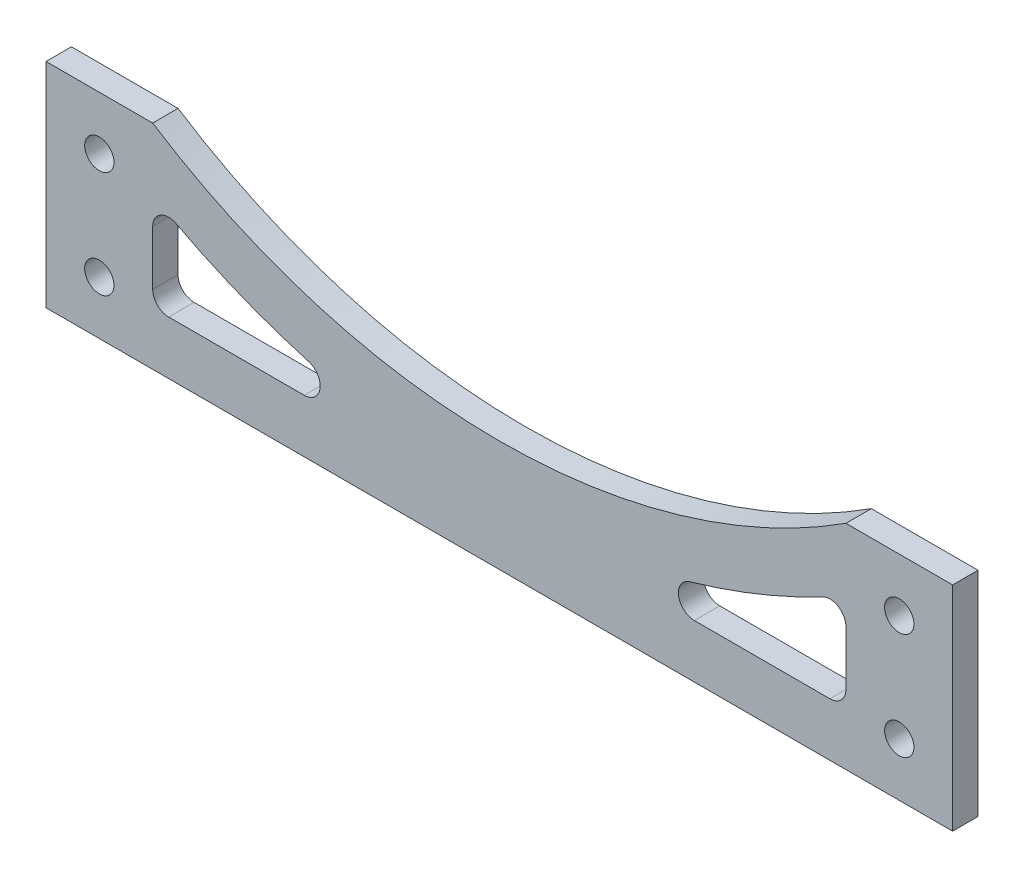
ISO-10303-21;
HEADER;
FILE_DESCRIPTION(('STEP AP214'),'2;1');
FILE_NAME('part.step','',(''),(''),'','','');
FILE_SCHEMA(('AUTOMOTIVE_DESIGN { 1 0 10303 214 1 1 1 1 }'));
ENDSEC;
DATA;
#1=APPLICATION_CONTEXT('core data for automotive mechanical design processes');
#2=APPLICATION_PROTOCOL_DEFINITION('international standard','automotive_design',2000,#1);
#3=PRODUCT_CONTEXT('',#1,'mechanical');
#4=PRODUCT('Part','Part','',(#3));
#5=PRODUCT_RELATED_PRODUCT_CATEGORY('part','',(#4));
#6=PRODUCT_DEFINITION_FORMATION('','',#4);
#7=PRODUCT_DEFINITION_CONTEXT('part definition',#1,'design');
#8=PRODUCT_DEFINITION('design','',#6,#7);
#9=PRODUCT_DEFINITION_SHAPE('','',#8);
#10=(LENGTH_UNIT() NAMED_UNIT(*) SI_UNIT(.MILLI.,.METRE.));
#11=(NAMED_UNIT(*) PLANE_ANGLE_UNIT() SI_UNIT($,.RADIAN.));
#12=(NAMED_UNIT(*) SI_UNIT($,.STERADIAN.) SOLID_ANGLE_UNIT());
#13=UNCERTAINTY_MEASURE_WITH_UNIT(LENGTH_MEASURE(1.E-05),#10,'distance_accuracy_value','');
#14=(GEOMETRIC_REPRESENTATION_CONTEXT(3) GLOBAL_UNCERTAINTY_ASSIGNED_CONTEXT((#13)) GLOBAL_UNIT_ASSIGNED_CONTEXT((#10,
#11,#12)) REPRESENTATION_CONTEXT('',''));
#15=CARTESIAN_POINT('',(0.,0.,0.));
#16=DIRECTION('',(0.,0.,1.));
#17=DIRECTION('',(1.,0.,0.));
#18=AXIS2_PLACEMENT_3D('',#15,#16,#17);
#19=CARTESIAN_POINT('',(0.,140.87120500916,4.7625));
#20=DIRECTION('',(0.,0.,1.));
#21=DIRECTION('',(1.,0.,0.));
#22=AXIS2_PLACEMENT_3D('',#19,#20,#21);
#23=PLANE('',#22);
#24=CARTESIAN_POINT('',(0.,140.87120500916,4.7625));
#25=DIRECTION('',(0.,0.,-1.));
#26=DIRECTION('',(1.,0.,0.));
#27=AXIS2_PLACEMENT_3D('',#24,#25,#26);
#28=CIRCLE('',#27,130.);
#29=CARTESIAN_POINT('',(-35.7529970719825,15.8843128949435,4.7625));
#30=VERTEX_POINT('',#29);
#31=CARTESIAN_POINT('',(-60.6015037593985,25.8605196703638,4.7625));
#32=VERTEX_POINT('',#31);
#33=EDGE_CURVE('E211',#30,#32,#28,.T.);
#34=ORIENTED_EDGE('',*,*,#33,.F.);
#35=CARTESIAN_POINT('',(-36.578066235182,13.,4.7625));
#36=DIRECTION('',(0.,0.,1.));
#37=DIRECTION('',(1.,0.,0.));
#38=AXIS2_PLACEMENT_3D('',#35,#36,#37);
#39=CIRCLE('',#38,3.);
#40=CARTESIAN_POINT('',(-36.578066235182,10.,4.7625));
#41=VERTEX_POINT('',#40);
#42=EDGE_CURVE('E209',#41,#30,#39,.T.);
#43=ORIENTED_EDGE('',*,*,#42,.F.);
#44=DIRECTION('',(1.,0.,0.));
#45=VECTOR('',#44,1.);
#46=CARTESIAN_POINT('',(-62.,10.,4.7625));
#47=LINE('',#46,#45);
#48=CARTESIAN_POINT('',(-62.,10.,4.7625));
#49=VERTEX_POINT('',#48);
#50=EDGE_CURVE('E221',#49,#41,#47,.T.);
#51=ORIENTED_EDGE('',*,*,#50,.F.);
#52=CARTESIAN_POINT('',(-62.,13.,4.7625));
#53=DIRECTION('',(0.,0.,1.));
#54=DIRECTION('',(1.,0.,0.));
#55=AXIS2_PLACEMENT_3D('',#52,#53,#54);
#56=CIRCLE('',#55,3.);
#57=CARTESIAN_POINT('',(-65.,13.,4.7625));
#58=VERTEX_POINT('',#57);
#59=EDGE_CURVE('E218',#58,#49,#56,.T.);
#60=ORIENTED_EDGE('',*,*,#59,.F.);
#61=DIRECTION('',(0.,-1.,0.));
#62=VECTOR('',#61,1.);
#63=CARTESIAN_POINT('',(-65.,23.2064269317762,4.7625));
#64=LINE('',#63,#62);
#65=CARTESIAN_POINT('',(-65.,23.2064269317762,4.7625));
#66=VERTEX_POINT('',#65);
#67=EDGE_CURVE('E216',#66,#58,#64,.T.);
#68=ORIENTED_EDGE('',*,*,#67,.F.);
#69=CARTESIAN_POINT('',(-62.,23.2064269317762,4.7625));
#70=DIRECTION('',(0.,0.,1.));
#71=DIRECTION('',(1.,0.,0.));
#72=AXIS2_PLACEMENT_3D('',#69,#70,#71);
#73=CIRCLE('',#72,3.00000000000001);
#74=EDGE_CURVE('E214',#32,#66,#73,.T.);
#75=ORIENTED_EDGE('',*,*,#74,.F.);
#76=EDGE_LOOP('',(#34,#43,#51,#60,#68,#75));
#77=FACE_BOUND('',#76,.T.);
#78=CARTESIAN_POINT('',(75.,30.,4.7625));
#79=DIRECTION('',(0.,0.,1.));
#80=DIRECTION('',(1.,0.,0.));
#81=AXIS2_PLACEMENT_3D('',#78,#79,#80);
#82=CIRCLE('',#81,2.75000000000001);
#83=CARTESIAN_POINT('',(77.75,30.,4.7625));
#84=VERTEX_POINT('',#83);
#85=EDGE_CURVE('E260',#84,#84,#82,.T.);
#86=ORIENTED_EDGE('',*,*,#85,.F.);
#87=EDGE_LOOP('',(#86));
#88=FACE_BOUND('',#87,.T.);
#89=CARTESIAN_POINT('',(-75.,30.,4.7625));
#90=DIRECTION('',(0.,0.,1.));
#91=DIRECTION('',(1.,0.,0.));
#92=AXIS2_PLACEMENT_3D('',#89,#90,#91);
#93=CIRCLE('',#92,2.75000000000001);
#94=CARTESIAN_POINT('',(-72.25,30.,4.7625));
#95=VERTEX_POINT('',#94);
#96=EDGE_CURVE('E272',#95,#95,#93,.T.);
#97=ORIENTED_EDGE('',*,*,#96,.F.);
#98=EDGE_LOOP('',(#97));
#99=FACE_BOUND('',#98,.T.);
#100=DIRECTION('',(0.,-1.,0.));
#101=VECTOR('',#100,1.);
#102=CARTESIAN_POINT('',(-85.,0.,4.7625));
#103=LINE('',#102,#101);
#104=CARTESIAN_POINT('',(-85.,40.,4.7625));
#105=VERTEX_POINT('',#104);
#106=CARTESIAN_POINT('',(-85.,0.,4.7625));
#107=VERTEX_POINT('',#106);
#108=EDGE_CURVE('E278',#105,#107,#103,.T.);
#109=ORIENTED_EDGE('',*,*,#108,.T.);
#110=DIRECTION('',(1.,0.,0.));
#111=VECTOR('',#110,1.);
#112=CARTESIAN_POINT('',(-85.,0.,4.7625));
#113=LINE('',#112,#111);
#114=CARTESIAN_POINT('',(85.,0.,4.7625));
#115=VERTEX_POINT('',#114);
#116=EDGE_CURVE('E281',#107,#115,#113,.T.);
#117=ORIENTED_EDGE('',*,*,#116,.T.);
#118=DIRECTION('',(0.,1.,0.));
#119=VECTOR('',#118,1.);
#120=CARTESIAN_POINT('',(85.,0.,4.7625));
#121=LINE('',#120,#119);
#122=CARTESIAN_POINT('',(85.,40.,4.7625));
#123=VERTEX_POINT('',#122);
#124=EDGE_CURVE('E284',#115,#123,#121,.T.);
#125=ORIENTED_EDGE('',*,*,#124,.T.);
#126=DIRECTION('',(-1.,0.,0.));
#127=VECTOR('',#126,1.);
#128=CARTESIAN_POINT('',(85.,40.,4.7625));
#129=LINE('',#128,#127);
#130=CARTESIAN_POINT('',(65.,40.,4.7625));
#131=VERTEX_POINT('',#130);
#132=EDGE_CURVE('E286',#123,#131,#129,.T.);
#133=ORIENTED_EDGE('',*,*,#132,.T.);
#134=CARTESIAN_POINT('',(0.,140.87120500916,4.7625));
#135=DIRECTION('',(0.,0.,-1.));
#136=DIRECTION('',(1.,0.,0.));
#137=AXIS2_PLACEMENT_3D('',#134,#135,#136);
#138=CIRCLE('',#137,120.);
#139=CARTESIAN_POINT('',(-65.,40.,4.7625));
#140=VERTEX_POINT('',#139);
#141=EDGE_CURVE('E288',#131,#140,#138,.T.);
#142=ORIENTED_EDGE('',*,*,#141,.T.);
#143=DIRECTION('',(-1.,0.,0.));
#144=VECTOR('',#143,1.);
#145=CARTESIAN_POINT('',(-85.,40.,4.7625));
#146=LINE('',#145,#144);
#147=EDGE_CURVE('E290',#140,#105,#146,.T.);
#148=ORIENTED_EDGE('',*,*,#147,.T.);
#149=EDGE_LOOP('',(#109,#117,#125,#133,#142,#148));
#150=FACE_BOUND('',#149,.T.);
#151=CARTESIAN_POINT('',(-75.,10.,4.7625));
#152=DIRECTION('',(0.,0.,1.));
#153=DIRECTION('',(1.,0.,0.));
#154=AXIS2_PLACEMENT_3D('',#151,#152,#153);
#155=CIRCLE('',#154,2.75000000000001);
#156=CARTESIAN_POINT('',(-72.25,10.,4.7625));
#157=VERTEX_POINT('',#156);
#158=EDGE_CURVE('E266',#157,#157,#155,.T.);
#159=ORIENTED_EDGE('',*,*,#158,.F.);
#160=EDGE_LOOP('',(#159));
#161=FACE_BOUND('',#160,.T.);
#162=CARTESIAN_POINT('',(75.,10.,4.7625));
#163=DIRECTION('',(0.,0.,1.));
#164=DIRECTION('',(1.,0.,0.));
#165=AXIS2_PLACEMENT_3D('',#162,#163,#164);
#166=CIRCLE('',#165,2.75000000000001);
#167=CARTESIAN_POINT('',(77.75,10.,4.7625));
#168=VERTEX_POINT('',#167);
#169=EDGE_CURVE('E254',#168,#168,#166,.T.);
#170=ORIENTED_EDGE('',*,*,#169,.F.);
#171=EDGE_LOOP('',(#170));
#172=FACE_BOUND('',#171,.T.);
#173=DIRECTION('',(1.,0.,0.));
#174=VECTOR('',#173,1.);
#175=CARTESIAN_POINT('',(62.,10.,4.7625));
#176=LINE('',#175,#174);
#177=CARTESIAN_POINT('',(36.578066235182,10.,4.7625));
#178=VERTEX_POINT('',#177);
#179=CARTESIAN_POINT('',(62.,10.,4.7625));
#180=VERTEX_POINT('',#179);
#181=EDGE_CURVE('E166',#178,#180,#176,.T.);
#182=ORIENTED_EDGE('',*,*,#181,.F.);
#183=CARTESIAN_POINT('',(36.578066235182,13.,4.7625));
#184=DIRECTION('',(0.,0.,1.));
#185=DIRECTION('',(1.,0.,0.));
#186=AXIS2_PLACEMENT_3D('',#183,#184,#185);
#187=CIRCLE('',#186,3.);
#188=CARTESIAN_POINT('',(35.7529970719824,15.8843128949435,4.7625));
#189=VERTEX_POINT('',#188);
#190=EDGE_CURVE('E158',#189,#178,#187,.T.);
#191=ORIENTED_EDGE('',*,*,#190,.F.);
#192=CARTESIAN_POINT('',(0.,140.87120500916,4.7625));
#193=DIRECTION('',(0.,0.,-1.));
#194=DIRECTION('',(1.,0.,0.));
#195=AXIS2_PLACEMENT_3D('',#192,#193,#194);
#196=CIRCLE('',#195,130.);
#197=CARTESIAN_POINT('',(60.6015037593985,25.8605196703638,4.7625));
#198=VERTEX_POINT('',#197);
#199=EDGE_CURVE('E187',#198,#189,#196,.T.);
#200=ORIENTED_EDGE('',*,*,#199,.F.);
#201=CARTESIAN_POINT('',(62.,23.2064269317762,4.7625));
#202=DIRECTION('',(0.,0.,1.));
#203=DIRECTION('',(1.,0.,0.));
#204=AXIS2_PLACEMENT_3D('',#201,#202,#203);
#205=CIRCLE('',#204,3.00000000000001);
#206=CARTESIAN_POINT('',(65.,23.2064269317762,4.7625));
#207=VERTEX_POINT('',#206);
#208=EDGE_CURVE('E185',#207,#198,#205,.T.);
#209=ORIENTED_EDGE('',*,*,#208,.F.);
#210=DIRECTION('',(0.,1.,0.));
#211=VECTOR('',#210,1.);
#212=CARTESIAN_POINT('',(65.,23.2064269317762,4.7625));
#213=LINE('',#212,#211);
#214=CARTESIAN_POINT('',(65.,13.,4.7625));
#215=VERTEX_POINT('',#214);
#216=EDGE_CURVE('E181',#215,#207,#213,.T.);
#217=ORIENTED_EDGE('',*,*,#216,.F.);
#218=CARTESIAN_POINT('',(62.,13.,4.7625));
#219=DIRECTION('',(0.,0.,1.));
#220=DIRECTION('',(-1.,0.,0.));
#221=AXIS2_PLACEMENT_3D('',#218,#219,#220);
#222=CIRCLE('',#221,3.);
#223=EDGE_CURVE('E179',#180,#215,#222,.T.);
#224=ORIENTED_EDGE('',*,*,#223,.F.);
#225=EDGE_LOOP('',(#182,#191,#200,#209,#217,#224));
#226=FACE_BOUND('',#225,.T.);
#227=ADVANCED_FACE('F33',(#77,#88,#99,#150,#161,#172,#226),#23,.T.);
#228=CARTESIAN_POINT('',(0.,140.87120500916,0.));
#229=DIRECTION('',(0.,0.,1.));
#230=DIRECTION('',(1.,0.,0.));
#231=AXIS2_PLACEMENT_3D('',#228,#229,#230);
#232=PLANE('',#231);
#233=CARTESIAN_POINT('',(-36.578066235182,13.,0.));
#234=DIRECTION('',(0.,0.,1.));
#235=DIRECTION('',(1.,0.,0.));
#236=AXIS2_PLACEMENT_3D('',#233,#234,#235);
#237=CIRCLE('',#236,3.);
#238=CARTESIAN_POINT('',(-36.578066235182,10.,0.));
#239=VERTEX_POINT('',#238);
#240=CARTESIAN_POINT('',(-35.7529970719825,15.8843128949435,0.));
#241=VERTEX_POINT('',#240);
#242=EDGE_CURVE('E174',#239,#241,#237,.T.);
#243=ORIENTED_EDGE('',*,*,#242,.T.);
#244=CARTESIAN_POINT('',(0.,140.87120500916,0.));
#245=DIRECTION('',(0.,0.,-1.));
#246=DIRECTION('',(1.,0.,0.));
#247=AXIS2_PLACEMENT_3D('',#244,#245,#246);
#248=CIRCLE('',#247,130.);
#249=CARTESIAN_POINT('',(-60.6015037593985,25.8605196703638,0.));
#250=VERTEX_POINT('',#249);
#251=EDGE_CURVE('E226',#241,#250,#248,.T.);
#252=ORIENTED_EDGE('',*,*,#251,.T.);
#253=CARTESIAN_POINT('',(-62.,23.2064269317762,0.));
#254=DIRECTION('',(0.,0.,1.));
#255=DIRECTION('',(1.,0.,0.));
#256=AXIS2_PLACEMENT_3D('',#253,#254,#255);
#257=CIRCLE('',#256,3.00000000000001);
#258=CARTESIAN_POINT('',(-65.,23.2064269317762,0.));
#259=VERTEX_POINT('',#258);
#260=EDGE_CURVE('E229',#250,#259,#257,.T.);
#261=ORIENTED_EDGE('',*,*,#260,.T.);
#262=DIRECTION('',(0.,-1.,0.));
#263=VECTOR('',#262,1.);
#264=CARTESIAN_POINT('',(-65.,23.2064269317762,0.));
#265=LINE('',#264,#263);
#266=CARTESIAN_POINT('',(-65.,13.,0.));
#267=VERTEX_POINT('',#266);
#268=EDGE_CURVE('E232',#259,#267,#265,.T.);
#269=ORIENTED_EDGE('',*,*,#268,.T.);
#270=CARTESIAN_POINT('',(-62.,13.,0.));
#271=DIRECTION('',(0.,0.,1.));
#272=DIRECTION('',(1.,0.,0.));
#273=AXIS2_PLACEMENT_3D('',#270,#271,#272);
#274=CIRCLE('',#273,3.);
#275=CARTESIAN_POINT('',(-62.,10.,0.));
#276=VERTEX_POINT('',#275);
#277=EDGE_CURVE('E235',#267,#276,#274,.T.);
#278=ORIENTED_EDGE('',*,*,#277,.T.);
#279=DIRECTION('',(1.,0.,0.));
#280=VECTOR('',#279,1.);
#281=CARTESIAN_POINT('',(-62.,10.,0.));
#282=LINE('',#281,#280);
#283=EDGE_CURVE('E212',#276,#239,#282,.T.);
#284=ORIENTED_EDGE('',*,*,#283,.T.);
#285=EDGE_LOOP('',(#243,#252,#261,#269,#278,#284));
#286=FACE_BOUND('',#285,.T.);
#287=CARTESIAN_POINT('',(75.,30.,0.));
#288=DIRECTION('',(0.,0.,1.));
#289=DIRECTION('',(1.,0.,0.));
#290=AXIS2_PLACEMENT_3D('',#287,#288,#289);
#291=CIRCLE('',#290,2.75000000000001);
#292=CARTESIAN_POINT('',(77.75,30.,0.));
#293=VERTEX_POINT('',#292);
#294=EDGE_CURVE('E257',#293,#293,#291,.T.);
#295=ORIENTED_EDGE('',*,*,#294,.T.);
#296=EDGE_LOOP('',(#295));
#297=FACE_BOUND('',#296,.T.);
#298=CARTESIAN_POINT('',(-75.,30.,0.));
#299=DIRECTION('',(0.,0.,1.));
#300=DIRECTION('',(1.,0.,0.));
#301=AXIS2_PLACEMENT_3D('',#298,#299,#300);
#302=CIRCLE('',#301,2.75000000000001);
#303=CARTESIAN_POINT('',(-72.25,30.,0.));
#304=VERTEX_POINT('',#303);
#305=EDGE_CURVE('E269',#304,#304,#302,.T.);
#306=ORIENTED_EDGE('',*,*,#305,.T.);
#307=EDGE_LOOP('',(#306));
#308=FACE_BOUND('',#307,.T.);
#309=DIRECTION('',(0.,-1.,0.));
#310=VECTOR('',#309,1.);
#311=CARTESIAN_POINT('',(-85.,0.,0.));
#312=LINE('',#311,#310);
#313=CARTESIAN_POINT('',(-85.,40.,0.));
#314=VERTEX_POINT('',#313);
#315=CARTESIAN_POINT('',(-85.,0.,0.));
#316=VERTEX_POINT('',#315);
#317=EDGE_CURVE('E275',#314,#316,#312,.T.);
#318=ORIENTED_EDGE('',*,*,#317,.F.);
#319=DIRECTION('',(-1.,0.,0.));
#320=VECTOR('',#319,1.);
#321=CARTESIAN_POINT('',(-85.,40.,0.));
#322=LINE('',#321,#320);
#323=CARTESIAN_POINT('',(-65.,40.,0.));
#324=VERTEX_POINT('',#323);
#325=EDGE_CURVE('E282',#324,#314,#322,.T.);
#326=ORIENTED_EDGE('',*,*,#325,.F.);
#327=CARTESIAN_POINT('',(0.,140.87120500916,0.));
#328=DIRECTION('',(0.,0.,-1.));
#329=DIRECTION('',(1.,0.,0.));
#330=AXIS2_PLACEMENT_3D('',#327,#328,#329);
#331=CIRCLE('',#330,120.);
#332=CARTESIAN_POINT('',(65.,40.,0.));
#333=VERTEX_POINT('',#332);
#334=EDGE_CURVE('E301',#333,#324,#331,.T.);
#335=ORIENTED_EDGE('',*,*,#334,.F.);
#336=DIRECTION('',(-1.,0.,0.));
#337=VECTOR('',#336,1.);
#338=CARTESIAN_POINT('',(85.,40.,0.));
#339=LINE('',#338,#337);
#340=CARTESIAN_POINT('',(85.,40.,0.));
#341=VERTEX_POINT('',#340);
#342=EDGE_CURVE('E299',#341,#333,#339,.T.);
#343=ORIENTED_EDGE('',*,*,#342,.F.);
#344=DIRECTION('',(0.,1.,0.));
#345=VECTOR('',#344,1.);
#346=CARTESIAN_POINT('',(85.,0.,0.));
#347=LINE('',#346,#345);
#348=CARTESIAN_POINT('',(85.,0.,0.));
#349=VERTEX_POINT('',#348);
#350=EDGE_CURVE('E297',#349,#341,#347,.T.);
#351=ORIENTED_EDGE('',*,*,#350,.F.);
#352=DIRECTION('',(1.,0.,0.));
#353=VECTOR('',#352,1.);
#354=CARTESIAN_POINT('',(-85.,0.,0.));
#355=LINE('',#354,#353);
#356=EDGE_CURVE('E295',#316,#349,#355,.T.);
#357=ORIENTED_EDGE('',*,*,#356,.F.);
#358=EDGE_LOOP('',(#318,#326,#335,#343,#351,#357));
#359=FACE_BOUND('',#358,.T.);
#360=CARTESIAN_POINT('',(-75.,10.,0.));
#361=DIRECTION('',(0.,0.,1.));
#362=DIRECTION('',(1.,0.,0.));
#363=AXIS2_PLACEMENT_3D('',#360,#361,#362);
#364=CIRCLE('',#363,2.75000000000001);
#365=CARTESIAN_POINT('',(-72.25,10.,0.));
#366=VERTEX_POINT('',#365);
#367=EDGE_CURVE('E263',#366,#366,#364,.T.);
#368=ORIENTED_EDGE('',*,*,#367,.T.);
#369=EDGE_LOOP('',(#368));
#370=FACE_BOUND('',#369,.T.);
#371=CARTESIAN_POINT('',(75.,10.,0.));
#372=DIRECTION('',(0.,0.,1.));
#373=DIRECTION('',(1.,0.,0.));
#374=AXIS2_PLACEMENT_3D('',#371,#372,#373);
#375=CIRCLE('',#374,2.75000000000001);
#376=CARTESIAN_POINT('',(77.75,10.,0.));
#377=VERTEX_POINT('',#376);
#378=EDGE_CURVE('E253',#377,#377,#375,.T.);
#379=ORIENTED_EDGE('',*,*,#378,.T.);
#380=EDGE_LOOP('',(#379));
#381=FACE_BOUND('',#380,.T.);
#382=CARTESIAN_POINT('',(36.578066235182,13.,0.));
#383=DIRECTION('',(0.,0.,1.));
#384=DIRECTION('',(1.,0.,0.));
#385=AXIS2_PLACEMENT_3D('',#382,#383,#384);
#386=CIRCLE('',#385,3.);
#387=CARTESIAN_POINT('',(35.7529970719824,15.8843128949435,0.));
#388=VERTEX_POINT('',#387);
#389=CARTESIAN_POINT('',(36.578066235182,10.,0.));
#390=VERTEX_POINT('',#389);
#391=EDGE_CURVE('E56',#388,#390,#386,.T.);
#392=ORIENTED_EDGE('',*,*,#391,.T.);
#393=DIRECTION('',(1.,0.,0.));
#394=VECTOR('',#393,1.);
#395=CARTESIAN_POINT('',(62.,10.,0.));
#396=LINE('',#395,#394);
#397=CARTESIAN_POINT('',(62.,10.,0.));
#398=VERTEX_POINT('',#397);
#399=EDGE_CURVE('E173',#390,#398,#396,.T.);
#400=ORIENTED_EDGE('',*,*,#399,.T.);
#401=CARTESIAN_POINT('',(62.,13.,0.));
#402=DIRECTION('',(0.,0.,1.));
#403=DIRECTION('',(-1.,0.,0.));
#404=AXIS2_PLACEMENT_3D('',#401,#402,#403);
#405=CIRCLE('',#404,3.);
#406=CARTESIAN_POINT('',(65.,13.,0.));
#407=VERTEX_POINT('',#406);
#408=EDGE_CURVE('E191',#398,#407,#405,.T.);
#409=ORIENTED_EDGE('',*,*,#408,.T.);
#410=DIRECTION('',(0.,1.,0.));
#411=VECTOR('',#410,1.);
#412=CARTESIAN_POINT('',(65.,23.2064269317762,0.));
#413=LINE('',#412,#411);
#414=CARTESIAN_POINT('',(65.,23.2064269317762,0.));
#415=VERTEX_POINT('',#414);
#416=EDGE_CURVE('E194',#407,#415,#413,.T.);
#417=ORIENTED_EDGE('',*,*,#416,.T.);
#418=CARTESIAN_POINT('',(62.,23.2064269317762,0.));
#419=DIRECTION('',(0.,0.,1.));
#420=DIRECTION('',(1.,0.,0.));
#421=AXIS2_PLACEMENT_3D('',#418,#419,#420);
#422=CIRCLE('',#421,3.00000000000001);
#423=CARTESIAN_POINT('',(60.6015037593985,25.8605196703638,0.));
#424=VERTEX_POINT('',#423);
#425=EDGE_CURVE('E197',#415,#424,#422,.T.);
#426=ORIENTED_EDGE('',*,*,#425,.T.);
#427=CARTESIAN_POINT('',(0.,140.87120500916,0.));
#428=DIRECTION('',(0.,0.,-1.));
#429=DIRECTION('',(1.,0.,0.));
#430=AXIS2_PLACEMENT_3D('',#427,#428,#429);
#431=CIRCLE('',#430,130.);
#432=EDGE_CURVE('E167',#424,#388,#431,.T.);
#433=ORIENTED_EDGE('',*,*,#432,.T.);
#434=EDGE_LOOP('',(#392,#400,#409,#417,#426,#433));
#435=FACE_BOUND('',#434,.T.);
#436=ADVANCED_FACE('F325',(#286,#297,#308,#359,#370,#381,#435),#232,.F.);
#437=CARTESIAN_POINT('',(-85.,0.,4.7625));
#438=DIRECTION('',(1.,0.,0.));
#439=DIRECTION('',(0.,0.,-1.));
#440=AXIS2_PLACEMENT_3D('',#437,#438,#439);
#441=PLANE('',#440);
#442=ORIENTED_EDGE('',*,*,#317,.T.);
#443=DIRECTION('',(0.,0.,-1.));
#444=VECTOR('',#443,1.);
#445=CARTESIAN_POINT('',(-85.,0.,4.7625));
#446=LINE('',#445,#444);
#447=EDGE_CURVE('E11',#107,#316,#446,.T.);
#448=ORIENTED_EDGE('',*,*,#447,.F.);
#449=ORIENTED_EDGE('',*,*,#108,.F.);
#450=DIRECTION('',(0.,0.,-1.));
#451=VECTOR('',#450,1.);
#452=CARTESIAN_POINT('',(-85.,40.,4.7625));
#453=LINE('',#452,#451);
#454=EDGE_CURVE('E292',#105,#314,#453,.T.);
#455=ORIENTED_EDGE('',*,*,#454,.T.);
#456=EDGE_LOOP('',(#442,#448,#449,#455));
#457=FACE_BOUND('',#456,.T.);
#458=ADVANCED_FACE('F35',(#457),#441,.F.);
#459=CARTESIAN_POINT('',(-85.,0.,4.7625));
#460=DIRECTION('',(0.,1.,0.));
#461=DIRECTION('',(0.,0.,1.));
#462=AXIS2_PLACEMENT_3D('',#459,#460,#461);
#463=PLANE('',#462);
#464=ORIENTED_EDGE('',*,*,#356,.T.);
#465=DIRECTION('',(0.,0.,-1.));
#466=VECTOR('',#465,1.);
#467=CARTESIAN_POINT('',(85.,0.,4.7625));
#468=LINE('',#467,#466);
#469=EDGE_CURVE('E41',#115,#349,#468,.T.);
#470=ORIENTED_EDGE('',*,*,#469,.F.);
#471=ORIENTED_EDGE('',*,*,#116,.F.);
#472=ORIENTED_EDGE('',*,*,#447,.T.);
#473=EDGE_LOOP('',(#464,#470,#471,#472));
#474=FACE_BOUND('',#473,.T.);
#475=ADVANCED_FACE('F343',(#474),#463,.F.);
#476=CARTESIAN_POINT('',(85.,0.,4.7625));
#477=DIRECTION('',(-1.,0.,0.));
#478=DIRECTION('',(0.,0.,1.));
#479=AXIS2_PLACEMENT_3D('',#476,#477,#478);
#480=PLANE('',#479);
#481=ORIENTED_EDGE('',*,*,#350,.T.);
#482=DIRECTION('',(0.,0.,-1.));
#483=VECTOR('',#482,1.);
#484=CARTESIAN_POINT('',(85.,40.,4.7625));
#485=LINE('',#484,#483);
#486=EDGE_CURVE('E312',#123,#341,#485,.T.);
#487=ORIENTED_EDGE('',*,*,#486,.F.);
#488=ORIENTED_EDGE('',*,*,#124,.F.);
#489=ORIENTED_EDGE('',*,*,#469,.T.);
#490=EDGE_LOOP('',(#481,#487,#488,#489));
#491=FACE_BOUND('',#490,.T.);
#492=ADVANCED_FACE('F319',(#491),#480,.F.);
#493=CARTESIAN_POINT('',(85.,40.,4.7625));
#494=DIRECTION('',(0.,-1.,0.));
#495=DIRECTION('',(1.,0.,0.));
#496=AXIS2_PLACEMENT_3D('',#493,#494,#495);
#497=PLANE('',#496);
#498=ORIENTED_EDGE('',*,*,#342,.T.);
#499=DIRECTION('',(0.,0.,-1.));
#500=VECTOR('',#499,1.);
#501=CARTESIAN_POINT('',(65.,40.,4.7625));
#502=LINE('',#501,#500);
#503=EDGE_CURVE('E309',#131,#333,#502,.T.);
#504=ORIENTED_EDGE('',*,*,#503,.F.);
#505=ORIENTED_EDGE('',*,*,#132,.F.);
#506=ORIENTED_EDGE('',*,*,#486,.T.);
#507=EDGE_LOOP('',(#498,#504,#505,#506));
#508=FACE_BOUND('',#507,.T.);
#509=ADVANCED_FACE('F331',(#508),#497,.F.);
#510=CARTESIAN_POINT('',(0.,140.87120500916,4.7625));
#511=DIRECTION('',(0.,0.,-1.));
#512=DIRECTION('',(-1.,0.,0.));
#513=AXIS2_PLACEMENT_3D('',#510,#511,#512);
#514=CYLINDRICAL_SURFACE('',#513,120.);
#515=ORIENTED_EDGE('',*,*,#334,.T.);
#516=DIRECTION('',(0.,0.,-1.));
#517=VECTOR('',#516,1.);
#518=CARTESIAN_POINT('',(-65.,40.,4.7625));
#519=LINE('',#518,#517);
#520=EDGE_CURVE('E306',#140,#324,#519,.T.);
#521=ORIENTED_EDGE('',*,*,#520,.F.);
#522=ORIENTED_EDGE('',*,*,#141,.F.);
#523=ORIENTED_EDGE('',*,*,#503,.T.);
#524=EDGE_LOOP('',(#515,#521,#522,#523));
#525=FACE_BOUND('',#524,.T.);
#526=ADVANCED_FACE('F335',(#525),#514,.F.);
#527=CARTESIAN_POINT('',(-85.,40.,4.7625));
#528=DIRECTION('',(0.,-1.,0.));
#529=DIRECTION('',(1.,0.,0.));
#530=AXIS2_PLACEMENT_3D('',#527,#528,#529);
#531=PLANE('',#530);
#532=ORIENTED_EDGE('',*,*,#325,.T.);
#533=ORIENTED_EDGE('',*,*,#454,.F.);
#534=ORIENTED_EDGE('',*,*,#147,.F.);
#535=ORIENTED_EDGE('',*,*,#520,.T.);
#536=EDGE_LOOP('',(#532,#533,#534,#535));
#537=FACE_BOUND('',#536,.T.);
#538=ADVANCED_FACE('F346',(#537),#531,.F.);
#539=CARTESIAN_POINT('',(-75.,30.,4.7625));
#540=DIRECTION('',(0.,0.,-1.));
#541=DIRECTION('',(-1.,0.,0.));
#542=AXIS2_PLACEMENT_3D('',#539,#540,#541);
#543=CYLINDRICAL_SURFACE('',#542,2.75000000000001);
#544=ORIENTED_EDGE('',*,*,#96,.T.);
#545=EDGE_LOOP('',(#544));
#546=FACE_BOUND('',#545,.T.);
#547=ORIENTED_EDGE('',*,*,#305,.F.);
#548=EDGE_LOOP('',(#547));
#549=FACE_BOUND('',#548,.T.);
#550=ADVANCED_FACE('F348',(#546,#549),#543,.F.);
#551=CARTESIAN_POINT('',(-75.,10.,4.7625));
#552=DIRECTION('',(0.,0.,-1.));
#553=DIRECTION('',(-1.,0.,0.));
#554=AXIS2_PLACEMENT_3D('',#551,#552,#553);
#555=CYLINDRICAL_SURFACE('',#554,2.75000000000001);
#556=ORIENTED_EDGE('',*,*,#158,.T.);
#557=EDGE_LOOP('',(#556));
#558=FACE_BOUND('',#557,.T.);
#559=ORIENTED_EDGE('',*,*,#367,.F.);
#560=EDGE_LOOP('',(#559));
#561=FACE_BOUND('',#560,.T.);
#562=ADVANCED_FACE('F354',(#558,#561),#555,.F.);
#563=CARTESIAN_POINT('',(75.,30.,4.7625));
#564=DIRECTION('',(0.,0.,-1.));
#565=DIRECTION('',(-1.,0.,0.));
#566=AXIS2_PLACEMENT_3D('',#563,#564,#565);
#567=CYLINDRICAL_SURFACE('',#566,2.75000000000001);
#568=ORIENTED_EDGE('',*,*,#85,.T.);
#569=EDGE_LOOP('',(#568));
#570=FACE_BOUND('',#569,.T.);
#571=ORIENTED_EDGE('',*,*,#294,.F.);
#572=EDGE_LOOP('',(#571));
#573=FACE_BOUND('',#572,.T.);
#574=ADVANCED_FACE('F371',(#570,#573),#567,.F.);
#575=CARTESIAN_POINT('',(75.,10.,4.7625));
#576=DIRECTION('',(0.,0.,-1.));
#577=DIRECTION('',(-1.,0.,0.));
#578=AXIS2_PLACEMENT_3D('',#575,#576,#577);
#579=CYLINDRICAL_SURFACE('',#578,2.75000000000001);
#580=ORIENTED_EDGE('',*,*,#169,.T.);
#581=EDGE_LOOP('',(#580));
#582=FACE_BOUND('',#581,.T.);
#583=ORIENTED_EDGE('',*,*,#378,.F.);
#584=EDGE_LOOP('',(#583));
#585=FACE_BOUND('',#584,.T.);
#586=ADVANCED_FACE('F375',(#582,#585),#579,.F.);
#587=CARTESIAN_POINT('',(-36.578066235182,13.,4.7625));
#588=DIRECTION('',(0.,0.,-1.));
#589=DIRECTION('',(-1.,0.,0.));
#590=AXIS2_PLACEMENT_3D('',#587,#588,#589);
#591=CYLINDRICAL_SURFACE('',#590,3.);
#592=ORIENTED_EDGE('',*,*,#242,.F.);
#593=DIRECTION('',(0.,0.,-1.));
#594=VECTOR('',#593,1.);
#595=CARTESIAN_POINT('',(-36.578066235182,10.,4.7625));
#596=LINE('',#595,#594);
#597=EDGE_CURVE('E223',#41,#239,#596,.T.);
#598=ORIENTED_EDGE('',*,*,#597,.F.);
#599=ORIENTED_EDGE('',*,*,#42,.T.);
#600=DIRECTION('',(0.,0.,-1.));
#601=VECTOR('',#600,1.);
#602=CARTESIAN_POINT('',(-35.7529970719825,15.8843128949435,4.7625));
#603=LINE('',#602,#601);
#604=EDGE_CURVE('E250',#30,#241,#603,.T.);
#605=ORIENTED_EDGE('',*,*,#604,.T.);
#606=EDGE_LOOP('',(#592,#598,#599,#605));
#607=FACE_BOUND('',#606,.T.);
#608=ADVANCED_FACE('F379',(#607),#591,.F.);
#609=CARTESIAN_POINT('',(0.,140.87120500916,4.7625));
#610=DIRECTION('',(0.,0.,-1.));
#611=DIRECTION('',(-1.,0.,0.));
#612=AXIS2_PLACEMENT_3D('',#609,#610,#611);
#613=CYLINDRICAL_SURFACE('',#612,130.);
#614=ORIENTED_EDGE('',*,*,#251,.F.);
#615=ORIENTED_EDGE('',*,*,#604,.F.);
#616=ORIENTED_EDGE('',*,*,#33,.T.);
#617=DIRECTION('',(0.,0.,-1.));
#618=VECTOR('',#617,1.);
#619=CARTESIAN_POINT('',(-60.6015037593985,25.8605196703638,4.7625));
#620=LINE('',#619,#618);
#621=EDGE_CURVE('E248',#32,#250,#620,.T.);
#622=ORIENTED_EDGE('',*,*,#621,.T.);
#623=EDGE_LOOP('',(#614,#615,#616,#622));
#624=FACE_BOUND('',#623,.T.);
#625=ADVANCED_FACE('F383',(#624),#613,.T.);
#626=CARTESIAN_POINT('',(-62.,23.2064269317762,4.7625));
#627=DIRECTION('',(0.,0.,-1.));
#628=DIRECTION('',(-1.,0.,0.));
#629=AXIS2_PLACEMENT_3D('',#626,#627,#628);
#630=CYLINDRICAL_SURFACE('',#629,3.00000000000001);
#631=ORIENTED_EDGE('',*,*,#260,.F.);
#632=ORIENTED_EDGE('',*,*,#621,.F.);
#633=ORIENTED_EDGE('',*,*,#74,.T.);
#634=DIRECTION('',(0.,0.,-1.));
#635=VECTOR('',#634,1.);
#636=CARTESIAN_POINT('',(-65.,23.2064269317762,4.7625));
#637=LINE('',#636,#635);
#638=EDGE_CURVE('E246',#66,#259,#637,.T.);
#639=ORIENTED_EDGE('',*,*,#638,.T.);
#640=EDGE_LOOP('',(#631,#632,#633,#639));
#641=FACE_BOUND('',#640,.T.);
#642=ADVANCED_FACE('F387',(#641),#630,.F.);
#643=CARTESIAN_POINT('',(-65.,23.2064269317762,4.7625));
#644=DIRECTION('',(1.,0.,0.));
#645=DIRECTION('',(0.,0.,-1.));
#646=AXIS2_PLACEMENT_3D('',#643,#644,#645);
#647=PLANE('',#646);
#648=ORIENTED_EDGE('',*,*,#268,.F.);
#649=ORIENTED_EDGE('',*,*,#638,.F.);
#650=ORIENTED_EDGE('',*,*,#67,.T.);
#651=DIRECTION('',(0.,0.,-1.));
#652=VECTOR('',#651,1.);
#653=CARTESIAN_POINT('',(-65.,13.,4.7625));
#654=LINE('',#653,#652);
#655=EDGE_CURVE('E244',#58,#267,#654,.T.);
#656=ORIENTED_EDGE('',*,*,#655,.T.);
#657=EDGE_LOOP('',(#648,#649,#650,#656));
#658=FACE_BOUND('',#657,.T.);
#659=ADVANCED_FACE('F391',(#658),#647,.T.);
#660=CARTESIAN_POINT('',(-62.,13.,4.7625));
#661=DIRECTION('',(0.,0.,-1.));
#662=DIRECTION('',(-1.,0.,0.));
#663=AXIS2_PLACEMENT_3D('',#660,#661,#662);
#664=CYLINDRICAL_SURFACE('',#663,3.);
#665=ORIENTED_EDGE('',*,*,#277,.F.);
#666=ORIENTED_EDGE('',*,*,#655,.F.);
#667=ORIENTED_EDGE('',*,*,#59,.T.);
#668=DIRECTION('',(0.,0.,-1.));
#669=VECTOR('',#668,1.);
#670=CARTESIAN_POINT('',(-62.,10.,4.7625));
#671=LINE('',#670,#669);
#672=EDGE_CURVE('E242',#49,#276,#671,.T.);
#673=ORIENTED_EDGE('',*,*,#672,.T.);
#674=EDGE_LOOP('',(#665,#666,#667,#673));
#675=FACE_BOUND('',#674,.T.);
#676=ADVANCED_FACE('F395',(#675),#664,.F.);
#677=CARTESIAN_POINT('',(-62.,10.,4.7625));
#678=DIRECTION('',(0.,1.,0.));
#679=DIRECTION('',(-1.,0.,0.));
#680=AXIS2_PLACEMENT_3D('',#677,#678,#679);
#681=PLANE('',#680);
#682=ORIENTED_EDGE('',*,*,#283,.F.);
#683=ORIENTED_EDGE('',*,*,#672,.F.);
#684=ORIENTED_EDGE('',*,*,#50,.T.);
#685=ORIENTED_EDGE('',*,*,#597,.T.);
#686=EDGE_LOOP('',(#682,#683,#684,#685));
#687=FACE_BOUND('',#686,.T.);
#688=ADVANCED_FACE('F399',(#687),#681,.T.);
#689=CARTESIAN_POINT('',(36.578066235182,13.,4.7625));
#690=DIRECTION('',(0.,0.,-1.));
#691=DIRECTION('',(-1.,0.,0.));
#692=AXIS2_PLACEMENT_3D('',#689,#690,#691);
#693=CYLINDRICAL_SURFACE('',#692,3.);
#694=ORIENTED_EDGE('',*,*,#391,.F.);
#695=DIRECTION('',(0.,0.,-1.));
#696=VECTOR('',#695,1.);
#697=CARTESIAN_POINT('',(35.7529970719824,15.8843128949435,4.7625));
#698=LINE('',#697,#696);
#699=EDGE_CURVE('E162',#189,#388,#698,.T.);
#700=ORIENTED_EDGE('',*,*,#699,.F.);
#701=ORIENTED_EDGE('',*,*,#190,.T.);
#702=DIRECTION('',(0.,0.,-1.));
#703=VECTOR('',#702,1.);
#704=CARTESIAN_POINT('',(36.578066235182,10.,4.7625));
#705=LINE('',#704,#703);
#706=EDGE_CURVE('E161',#178,#390,#705,.T.);
#707=ORIENTED_EDGE('',*,*,#706,.T.);
#708=EDGE_LOOP('',(#694,#700,#701,#707));
#709=FACE_BOUND('',#708,.T.);
#710=ADVANCED_FACE('F160',(#709),#693,.F.);
#711=CARTESIAN_POINT('',(62.,10.,4.7625));
#712=DIRECTION('',(0.,1.,0.));
#713=DIRECTION('',(-1.,0.,0.));
#714=AXIS2_PLACEMENT_3D('',#711,#712,#713);
#715=PLANE('',#714);
#716=ORIENTED_EDGE('',*,*,#399,.F.);
#717=ORIENTED_EDGE('',*,*,#706,.F.);
#718=ORIENTED_EDGE('',*,*,#181,.T.);
#719=DIRECTION('',(0.,0.,-1.));
#720=VECTOR('',#719,1.);
#721=CARTESIAN_POINT('',(62.,10.,4.7625));
#722=LINE('',#721,#720);
#723=EDGE_CURVE('E175',#180,#398,#722,.T.);
#724=ORIENTED_EDGE('',*,*,#723,.T.);
#725=EDGE_LOOP('',(#716,#717,#718,#724));
#726=FACE_BOUND('',#725,.T.);
#727=ADVANCED_FACE('F170',(#726),#715,.T.);
#728=CARTESIAN_POINT('',(62.,13.,4.7625));
#729=DIRECTION('',(0.,0.,-1.));
#730=DIRECTION('',(-1.,0.,0.));
#731=AXIS2_PLACEMENT_3D('',#728,#729,#730);
#732=CYLINDRICAL_SURFACE('',#731,3.);
#733=ORIENTED_EDGE('',*,*,#408,.F.);
#734=ORIENTED_EDGE('',*,*,#723,.F.);
#735=ORIENTED_EDGE('',*,*,#223,.T.);
#736=DIRECTION('',(0.,0.,-1.));
#737=VECTOR('',#736,1.);
#738=CARTESIAN_POINT('',(65.,13.,4.7625));
#739=LINE('',#738,#737);
#740=EDGE_CURVE('E206',#215,#407,#739,.T.);
#741=ORIENTED_EDGE('',*,*,#740,.T.);
#742=EDGE_LOOP('',(#733,#734,#735,#741));
#743=FACE_BOUND('',#742,.T.);
#744=ADVANCED_FACE('F408',(#743),#732,.F.);
#745=CARTESIAN_POINT('',(65.,23.2064269317762,4.7625));
#746=DIRECTION('',(-1.,0.,0.));
#747=DIRECTION('',(0.,0.,1.));
#748=AXIS2_PLACEMENT_3D('',#745,#746,#747);
#749=PLANE('',#748);
#750=ORIENTED_EDGE('',*,*,#416,.F.);
#751=ORIENTED_EDGE('',*,*,#740,.F.);
#752=ORIENTED_EDGE('',*,*,#216,.T.);
#753=DIRECTION('',(0.,0.,-1.));
#754=VECTOR('',#753,1.);
#755=CARTESIAN_POINT('',(65.,23.2064269317762,4.7625));
#756=LINE('',#755,#754);
#757=EDGE_CURVE('E204',#207,#415,#756,.T.);
#758=ORIENTED_EDGE('',*,*,#757,.T.);
#759=EDGE_LOOP('',(#750,#751,#752,#758));
#760=FACE_BOUND('',#759,.T.);
#761=ADVANCED_FACE('F411',(#760),#749,.T.);
#762=CARTESIAN_POINT('',(62.,23.2064269317762,4.7625));
#763=DIRECTION('',(0.,0.,-1.));
#764=DIRECTION('',(-1.,0.,0.));
#765=AXIS2_PLACEMENT_3D('',#762,#763,#764);
#766=CYLINDRICAL_SURFACE('',#765,3.00000000000001);
#767=ORIENTED_EDGE('',*,*,#425,.F.);
#768=ORIENTED_EDGE('',*,*,#757,.F.);
#769=ORIENTED_EDGE('',*,*,#208,.T.);
#770=DIRECTION('',(0.,0.,-1.));
#771=VECTOR('',#770,1.);
#772=CARTESIAN_POINT('',(60.6015037593985,25.8605196703638,4.7625));
#773=LINE('',#772,#771);
#774=EDGE_CURVE('E48',#198,#424,#773,.T.);
#775=ORIENTED_EDGE('',*,*,#774,.T.);
#776=EDGE_LOOP('',(#767,#768,#769,#775));
#777=FACE_BOUND('',#776,.T.);
#778=ADVANCED_FACE('F415',(#777),#766,.F.);
#779=CARTESIAN_POINT('',(0.,140.87120500916,4.7625));
#780=DIRECTION('',(0.,0.,-1.));
#781=DIRECTION('',(-1.,0.,0.));
#782=AXIS2_PLACEMENT_3D('',#779,#780,#781);
#783=CYLINDRICAL_SURFACE('',#782,130.);
#784=ORIENTED_EDGE('',*,*,#432,.F.);
#785=ORIENTED_EDGE('',*,*,#774,.F.);
#786=ORIENTED_EDGE('',*,*,#199,.T.);
#787=ORIENTED_EDGE('',*,*,#699,.T.);
#788=EDGE_LOOP('',(#784,#785,#786,#787));
#789=FACE_BOUND('',#788,.T.);
#790=ADVANCED_FACE('F419',(#789),#783,.T.);
#791=CLOSED_SHELL('',(#227,#436,#458,#475,#492,#509,#526,#538,#550,#562,#574,#586,#608,#625,
#642,#659,#676,#688,#710,#727,#744,#761,#778,#790));
#792=MANIFOLD_SOLID_BREP('B2',#791);
#793=ADVANCED_BREP_SHAPE_REPRESENTATION('',(#18,#792),#14);
#794=SHAPE_DEFINITION_REPRESENTATION(#9,#793);
ENDSEC;
END-ISO-10303-21;
